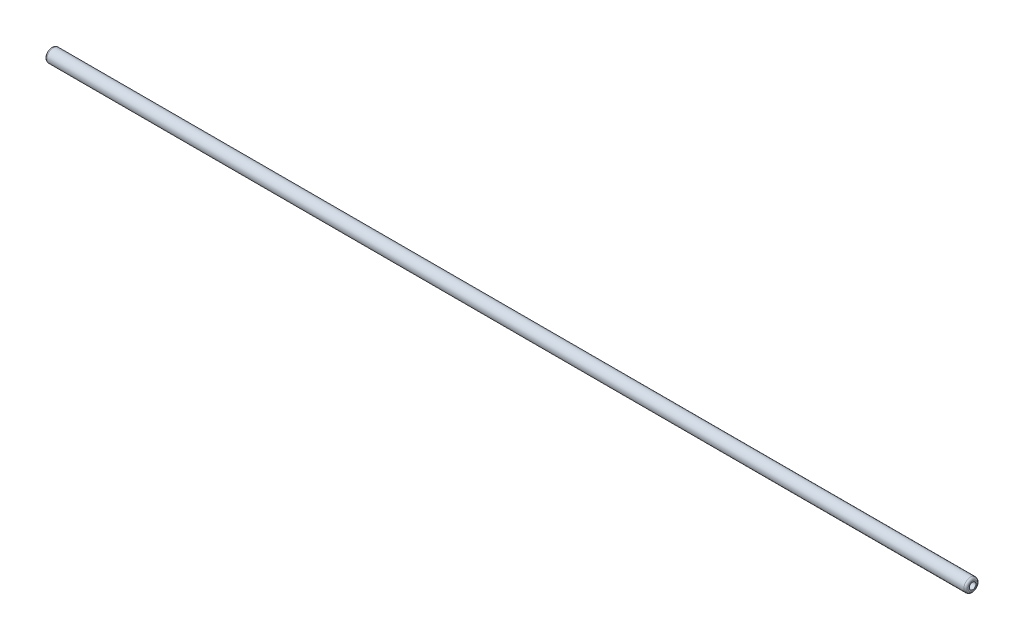
ISO-10303-21;
HEADER;
FILE_DESCRIPTION(('STEP AP214'),'2;1');
FILE_NAME('part.step','',(''),(''),'','','');
FILE_SCHEMA(('AUTOMOTIVE_DESIGN { 1 0 10303 214 1 1 1 1 }'));
ENDSEC;
DATA;
#1=APPLICATION_CONTEXT('core data for automotive mechanical design processes');
#2=APPLICATION_PROTOCOL_DEFINITION('international standard','automotive_design',2000,#1);
#3=PRODUCT_CONTEXT('',#1,'mechanical');
#4=PRODUCT('Part','Part','',(#3));
#5=PRODUCT_RELATED_PRODUCT_CATEGORY('part','',(#4));
#6=PRODUCT_DEFINITION_FORMATION('','',#4);
#7=PRODUCT_DEFINITION_CONTEXT('part definition',#1,'design');
#8=PRODUCT_DEFINITION('design','',#6,#7);
#9=PRODUCT_DEFINITION_SHAPE('','',#8);
#10=(LENGTH_UNIT() NAMED_UNIT(*) SI_UNIT(.MILLI.,.METRE.));
#11=(NAMED_UNIT(*) PLANE_ANGLE_UNIT() SI_UNIT($,.RADIAN.));
#12=(NAMED_UNIT(*) SI_UNIT($,.STERADIAN.) SOLID_ANGLE_UNIT());
#13=UNCERTAINTY_MEASURE_WITH_UNIT(LENGTH_MEASURE(1.E-05),#10,'distance_accuracy_value','');
#14=(GEOMETRIC_REPRESENTATION_CONTEXT(3) GLOBAL_UNCERTAINTY_ASSIGNED_CONTEXT((#13)) GLOBAL_UNIT_ASSIGNED_CONTEXT((#10,
#11,#12)) REPRESENTATION_CONTEXT('',''));
#15=CARTESIAN_POINT('',(0.,0.,0.));
#16=DIRECTION('',(0.,0.,1.));
#17=DIRECTION('',(1.,0.,0.));
#18=AXIS2_PLACEMENT_3D('',#15,#16,#17);
#19=CARTESIAN_POINT('',(-550.8625,-4.78374234235551E-10,0.));
#20=DIRECTION('',(-1.,-8.68409510967894E-13,0.));
#21=DIRECTION('',(0.,0.,1.));
#22=AXIS2_PLACEMENT_3D('',#19,#20,#21);
#23=PLANE('',#22);
#24=CARTESIAN_POINT('',(-550.8625,-4.78374234235551E-10,0.));
#25=DIRECTION('',(-1.,-8.68409510967894E-13,0.));
#26=DIRECTION('',(0.,0.,1.));
#27=AXIS2_PLACEMENT_3D('',#24,#25,#26);
#28=CIRCLE('',#27,5.4375);
#29=CARTESIAN_POINT('',(-550.8625,-4.78374234235551E-10,5.4375));
#30=VERTEX_POINT('',#29);
#31=EDGE_CURVE('E10',#30,#30,#28,.T.);
#32=ORIENTED_EDGE('',*,*,#31,.T.);
#33=EDGE_LOOP('',(#32));
#34=FACE_BOUND('',#33,.T.);
#35=CARTESIAN_POINT('',(-550.8625,-4.78374234235551E-10,0.));
#36=DIRECTION('',(-1.,-8.68409510967894E-13,0.));
#37=DIRECTION('',(0.,0.,1.));
#38=AXIS2_PLACEMENT_3D('',#35,#36,#37);
#39=CIRCLE('',#38,3.975);
#40=CARTESIAN_POINT('',(-550.8625,-4.78374234235551E-10,3.975));
#41=VERTEX_POINT('',#40);
#42=EDGE_CURVE('E66',#41,#41,#39,.T.);
#43=ORIENTED_EDGE('',*,*,#42,.F.);
#44=EDGE_LOOP('',(#43));
#45=FACE_BOUND('',#44,.T.);
#46=ADVANCED_FACE('F42',(#34,#45),#23,.T.);
#47=CARTESIAN_POINT('',(550.8625,4.78374234235551E-10,0.));
#48=DIRECTION('',(-1.,-8.68409510967894E-13,0.));
#49=DIRECTION('',(0.,0.,1.));
#50=AXIS2_PLACEMENT_3D('',#47,#48,#49);
#51=PLANE('',#50);
#52=CARTESIAN_POINT('',(550.8625,4.78374234235551E-10,0.));
#53=DIRECTION('',(-1.,-8.68409510967894E-13,0.));
#54=DIRECTION('',(0.,0.,1.));
#55=AXIS2_PLACEMENT_3D('',#52,#53,#54);
#56=CIRCLE('',#55,5.4375);
#57=CARTESIAN_POINT('',(550.8625,4.78374234235551E-10,5.4375));
#58=VERTEX_POINT('',#57);
#59=EDGE_CURVE('E50',#58,#58,#56,.F.);
#60=ORIENTED_EDGE('',*,*,#59,.T.);
#61=EDGE_LOOP('',(#60));
#62=FACE_BOUND('',#61,.T.);
#63=CARTESIAN_POINT('',(550.8625,4.78374234235551E-10,0.));
#64=DIRECTION('',(-1.,-8.68409510967894E-13,0.));
#65=DIRECTION('',(0.,0.,1.));
#66=AXIS2_PLACEMENT_3D('',#63,#64,#65);
#67=CIRCLE('',#66,3.975);
#68=CARTESIAN_POINT('',(550.8625,4.78374234235551E-10,3.975));
#69=VERTEX_POINT('',#68);
#70=EDGE_CURVE('E67',#69,#69,#67,.T.);
#71=ORIENTED_EDGE('',*,*,#70,.T.);
#72=EDGE_LOOP('',(#71));
#73=FACE_BOUND('',#72,.T.);
#74=ADVANCED_FACE('F79',(#62,#73),#51,.F.);
#75=CARTESIAN_POINT('',(-550.8625,-4.78374234235551E-10,0.));
#76=DIRECTION('',(1.,8.68409510967894E-13,0.));
#77=DIRECTION('',(0.,0.,-1.));
#78=AXIS2_PLACEMENT_3D('',#75,#76,#77);
#79=CYLINDRICAL_SURFACE('',#78,7.9375);
#80=CARTESIAN_POINT('',(548.3625,4.76203210458131E-10,0.));
#81=DIRECTION('',(-1.,-8.68409510967894E-13,0.));
#82=DIRECTION('',(0.,0.,1.));
#83=AXIS2_PLACEMENT_3D('',#80,#81,#82);
#84=CIRCLE('',#83,7.9375);
#85=CARTESIAN_POINT('',(548.3625,4.76203210458131E-10,7.9375));
#86=VERTEX_POINT('',#85);
#87=EDGE_CURVE('E55',#86,#86,#84,.T.);
#88=ORIENTED_EDGE('',*,*,#87,.T.);
#89=EDGE_LOOP('',(#88));
#90=FACE_BOUND('',#89,.T.);
#91=CARTESIAN_POINT('',(-548.3625,-4.76203210458131E-10,0.));
#92=DIRECTION('',(-1.,-8.68409510967894E-13,0.));
#93=DIRECTION('',(0.,0.,1.));
#94=AXIS2_PLACEMENT_3D('',#91,#92,#93);
#95=CIRCLE('',#94,7.9375);
#96=CARTESIAN_POINT('',(-548.3625,-4.76203210458131E-10,7.9375));
#97=VERTEX_POINT('',#96);
#98=EDGE_CURVE('E60',#97,#97,#95,.F.);
#99=ORIENTED_EDGE('',*,*,#98,.T.);
#100=EDGE_LOOP('',(#99));
#101=FACE_BOUND('',#100,.T.);
#102=ADVANCED_FACE('F84',(#90,#101),#79,.T.);
#103=CARTESIAN_POINT('',(-550.8625,-4.78374234235551E-10,0.));
#104=DIRECTION('',(1.,8.68409510967894E-13,0.));
#105=DIRECTION('',(0.,0.,-1.));
#106=AXIS2_PLACEMENT_3D('',#103,#104,#105);
#107=CYLINDRICAL_SURFACE('',#106,3.975);
#108=ORIENTED_EDGE('',*,*,#42,.T.);
#109=EDGE_LOOP('',(#108));
#110=FACE_BOUND('',#109,.T.);
#111=ORIENTED_EDGE('',*,*,#70,.F.);
#112=EDGE_LOOP('',(#111));
#113=FACE_BOUND('',#112,.T.);
#114=ADVANCED_FACE('F75',(#110,#113),#107,.F.);
#115=CARTESIAN_POINT('',(548.3625,4.76203210458131E-10,0.));
#116=DIRECTION('',(-1.,-8.68409510967894E-13,0.));
#117=DIRECTION('',(0.,0.,1.));
#118=AXIS2_PLACEMENT_3D('',#115,#116,#117);
#119=TOROIDAL_SURFACE('',#118,5.4375,2.5);
#120=ORIENTED_EDGE('',*,*,#59,.F.);
#121=EDGE_LOOP('',(#120));
#122=FACE_BOUND('',#121,.T.);
#123=ORIENTED_EDGE('',*,*,#87,.F.);
#124=EDGE_LOOP('',(#123));
#125=FACE_BOUND('',#124,.T.);
#126=ADVANCED_FACE('F90',(#122,#125),#119,.T.);
#127=CARTESIAN_POINT('',(-548.3625,-4.76203210458131E-10,0.));
#128=DIRECTION('',(-1.,-8.68409510967894E-13,0.));
#129=DIRECTION('',(0.,0.,1.));
#130=AXIS2_PLACEMENT_3D('',#127,#128,#129);
#131=TOROIDAL_SURFACE('',#130,5.4375,2.5);
#132=ORIENTED_EDGE('',*,*,#98,.F.);
#133=EDGE_LOOP('',(#132));
#134=FACE_BOUND('',#133,.T.);
#135=ORIENTED_EDGE('',*,*,#31,.F.);
#136=EDGE_LOOP('',(#135));
#137=FACE_BOUND('',#136,.T.);
#138=ADVANCED_FACE('F44',(#134,#137),#131,.T.);
#139=CLOSED_SHELL('',(#46,#74,#102,#114,#126,#138));
#140=MANIFOLD_SOLID_BREP('B2',#139);
#141=ADVANCED_BREP_SHAPE_REPRESENTATION('',(#18,#140),#14);
#142=SHAPE_DEFINITION_REPRESENTATION(#9,#141);
ENDSEC;
END-ISO-10303-21;
